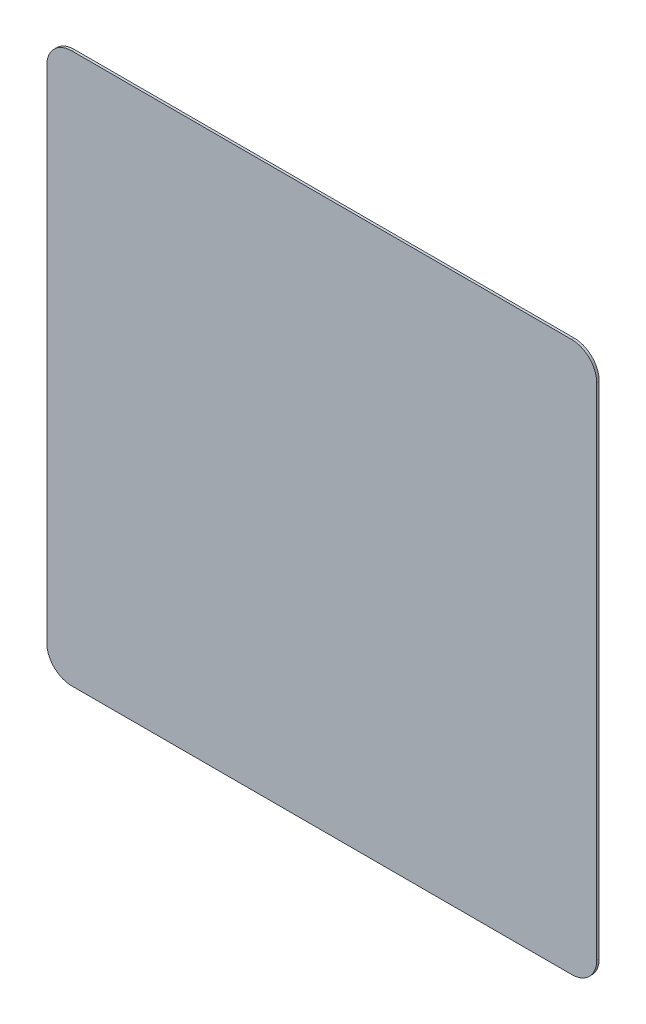
ISO-10303-21;
HEADER;
FILE_DESCRIPTION(('STEP AP214'),'2;1');
FILE_NAME('part.step','',(''),(''),'','','');
FILE_SCHEMA(('AUTOMOTIVE_DESIGN { 1 0 10303 214 1 1 1 1 }'));
ENDSEC;
DATA;
#1=APPLICATION_CONTEXT('core data for automotive mechanical design processes');
#2=APPLICATION_PROTOCOL_DEFINITION('international standard','automotive_design',2000,#1);
#3=PRODUCT_CONTEXT('',#1,'mechanical');
#4=PRODUCT('Part','Part','',(#3));
#5=PRODUCT_RELATED_PRODUCT_CATEGORY('part','',(#4));
#6=PRODUCT_DEFINITION_FORMATION('','',#4);
#7=PRODUCT_DEFINITION_CONTEXT('part definition',#1,'design');
#8=PRODUCT_DEFINITION('design','',#6,#7);
#9=PRODUCT_DEFINITION_SHAPE('','',#8);
#10=(LENGTH_UNIT() NAMED_UNIT(*) SI_UNIT(.MILLI.,.METRE.));
#11=(NAMED_UNIT(*) PLANE_ANGLE_UNIT() SI_UNIT($,.RADIAN.));
#12=(NAMED_UNIT(*) SI_UNIT($,.STERADIAN.) SOLID_ANGLE_UNIT());
#13=UNCERTAINTY_MEASURE_WITH_UNIT(LENGTH_MEASURE(1.E-05),#10,'distance_accuracy_value','');
#14=(GEOMETRIC_REPRESENTATION_CONTEXT(3) GLOBAL_UNCERTAINTY_ASSIGNED_CONTEXT((#13)) GLOBAL_UNIT_ASSIGNED_CONTEXT((#10,
#11,#12)) REPRESENTATION_CONTEXT('',''));
#15=CARTESIAN_POINT('',(0.,0.,0.));
#16=DIRECTION('',(0.,0.,1.));
#17=DIRECTION('',(1.,0.,0.));
#18=AXIS2_PLACEMENT_3D('',#15,#16,#17);
#19=CARTESIAN_POINT('',(-2.75,0.,0.025));
#20=DIRECTION('',(-1.,0.,0.));
#21=DIRECTION('',(0.,0.,1.));
#22=AXIS2_PLACEMENT_3D('',#19,#20,#21);
#23=PLANE('',#22);
#24=DIRECTION('',(0.,1.,0.));
#25=VECTOR('',#24,1.);
#26=CARTESIAN_POINT('',(-2.75,0.,0.025));
#27=LINE('',#26,#25);
#28=CARTESIAN_POINT('',(-2.75,-2.5,0.025));
#29=VERTEX_POINT('',#28);
#30=CARTESIAN_POINT('',(-2.75,2.5,0.025));
#31=VERTEX_POINT('',#30);
#32=EDGE_CURVE('E121',#29,#31,#27,.T.);
#33=ORIENTED_EDGE('',*,*,#32,.T.);
#34=DIRECTION('',(0.,0.,-1.));
#35=VECTOR('',#34,1.);
#36=CARTESIAN_POINT('',(-2.75,2.5,0.025));
#37=LINE('',#36,#35);
#38=CARTESIAN_POINT('',(-2.75,2.5,0.));
#39=VERTEX_POINT('',#38);
#40=EDGE_CURVE('E151',#31,#39,#37,.T.);
#41=ORIENTED_EDGE('',*,*,#40,.T.);
#42=DIRECTION('',(0.,1.,0.));
#43=VECTOR('',#42,1.);
#44=CARTESIAN_POINT('',(-2.75,0.,0.));
#45=LINE('',#44,#43);
#46=CARTESIAN_POINT('',(-2.75,-2.5,0.));
#47=VERTEX_POINT('',#46);
#48=EDGE_CURVE('E105',#47,#39,#45,.T.);
#49=ORIENTED_EDGE('',*,*,#48,.F.);
#50=DIRECTION('',(0.,0.,-1.));
#51=VECTOR('',#50,1.);
#52=CARTESIAN_POINT('',(-2.75,-2.5,0.025));
#53=LINE('',#52,#51);
#54=EDGE_CURVE('E149',#47,#29,#53,.F.);
#55=ORIENTED_EDGE('',*,*,#54,.T.);
#56=EDGE_LOOP('',(#33,#41,#49,#55));
#57=FACE_BOUND('',#56,.T.);
#58=ADVANCED_FACE('F35',(#57),#23,.T.);
#59=CARTESIAN_POINT('',(0.,-2.75,0.025));
#60=DIRECTION('',(0.,1.,0.));
#61=DIRECTION('',(0.,0.,1.));
#62=AXIS2_PLACEMENT_3D('',#59,#60,#61);
#63=PLANE('',#62);
#64=DIRECTION('',(1.,0.,0.));
#65=VECTOR('',#64,1.);
#66=CARTESIAN_POINT('',(0.,-2.75,0.));
#67=LINE('',#66,#65);
#68=CARTESIAN_POINT('',(-2.5,-2.75,0.));
#69=VERTEX_POINT('',#68);
#70=CARTESIAN_POINT('',(2.5,-2.75,0.));
#71=VERTEX_POINT('',#70);
#72=EDGE_CURVE('E156',#69,#71,#67,.T.);
#73=ORIENTED_EDGE('',*,*,#72,.T.);
#74=DIRECTION('',(0.,0.,-1.));
#75=VECTOR('',#74,1.);
#76=CARTESIAN_POINT('',(2.5,-2.75,0.025));
#77=LINE('',#76,#75);
#78=CARTESIAN_POINT('',(2.5,-2.75,0.025));
#79=VERTEX_POINT('',#78);
#80=EDGE_CURVE('E11',#71,#79,#77,.F.);
#81=ORIENTED_EDGE('',*,*,#80,.T.);
#82=DIRECTION('',(1.,0.,0.));
#83=VECTOR('',#82,1.);
#84=CARTESIAN_POINT('',(0.,-2.75,0.025));
#85=LINE('',#84,#83);
#86=CARTESIAN_POINT('',(-2.5,-2.75,0.025));
#87=VERTEX_POINT('',#86);
#88=EDGE_CURVE('E157',#87,#79,#85,.T.);
#89=ORIENTED_EDGE('',*,*,#88,.F.);
#90=DIRECTION('',(0.,0.,-1.));
#91=VECTOR('',#90,1.);
#92=CARTESIAN_POINT('',(-2.5,-2.75,0.));
#93=LINE('',#92,#91);
#94=EDGE_CURVE('E43',#87,#69,#93,.T.);
#95=ORIENTED_EDGE('',*,*,#94,.T.);
#96=EDGE_LOOP('',(#73,#81,#89,#95));
#97=FACE_BOUND('',#96,.T.);
#98=ADVANCED_FACE('F155',(#97),#63,.F.);
#99=CARTESIAN_POINT('',(2.75,0.,0.025));
#100=DIRECTION('',(-1.,0.,0.));
#101=DIRECTION('',(0.,0.,1.));
#102=AXIS2_PLACEMENT_3D('',#99,#100,#101);
#103=PLANE('',#102);
#104=DIRECTION('',(0.,1.,0.));
#105=VECTOR('',#104,1.);
#106=CARTESIAN_POINT('',(2.75,0.,0.));
#107=LINE('',#106,#105);
#108=CARTESIAN_POINT('',(2.75,-2.5,0.));
#109=VERTEX_POINT('',#108);
#110=CARTESIAN_POINT('',(2.75,2.5,0.));
#111=VERTEX_POINT('',#110);
#112=EDGE_CURVE('E122',#109,#111,#107,.T.);
#113=ORIENTED_EDGE('',*,*,#112,.T.);
#114=DIRECTION('',(0.,0.,-1.));
#115=VECTOR('',#114,1.);
#116=CARTESIAN_POINT('',(2.75,2.5,0.025));
#117=LINE('',#116,#115);
#118=CARTESIAN_POINT('',(2.75,2.5,0.025));
#119=VERTEX_POINT('',#118);
#120=EDGE_CURVE('E141',#111,#119,#117,.F.);
#121=ORIENTED_EDGE('',*,*,#120,.T.);
#122=DIRECTION('',(0.,1.,0.));
#123=VECTOR('',#122,1.);
#124=CARTESIAN_POINT('',(2.75,0.,0.025));
#125=LINE('',#124,#123);
#126=CARTESIAN_POINT('',(2.75,-2.5,0.025));
#127=VERTEX_POINT('',#126);
#128=EDGE_CURVE('E131',#127,#119,#125,.T.);
#129=ORIENTED_EDGE('',*,*,#128,.F.);
#130=DIRECTION('',(0.,0.,-1.));
#131=VECTOR('',#130,1.);
#132=CARTESIAN_POINT('',(2.75,-2.5,0.025));
#133=LINE('',#132,#131);
#134=EDGE_CURVE('E138',#127,#109,#133,.T.);
#135=ORIENTED_EDGE('',*,*,#134,.T.);
#136=EDGE_LOOP('',(#113,#121,#129,#135));
#137=FACE_BOUND('',#136,.T.);
#138=ADVANCED_FACE('F182',(#137),#103,.F.);
#139=CARTESIAN_POINT('',(0.,2.75,0.025));
#140=DIRECTION('',(0.,1.,0.));
#141=DIRECTION('',(0.,0.,1.));
#142=AXIS2_PLACEMENT_3D('',#139,#140,#141);
#143=PLANE('',#142);
#144=DIRECTION('',(1.,0.,0.));
#145=VECTOR('',#144,1.);
#146=CARTESIAN_POINT('',(0.,2.75,0.025));
#147=LINE('',#146,#145);
#148=CARTESIAN_POINT('',(-2.5,2.75,0.025));
#149=VERTEX_POINT('',#148);
#150=CARTESIAN_POINT('',(2.5,2.75,0.025));
#151=VERTEX_POINT('',#150);
#152=EDGE_CURVE('E127',#149,#151,#147,.T.);
#153=ORIENTED_EDGE('',*,*,#152,.T.);
#154=DIRECTION('',(0.,0.,-1.));
#155=VECTOR('',#154,1.);
#156=CARTESIAN_POINT('',(2.5,2.75,0.));
#157=LINE('',#156,#155);
#158=CARTESIAN_POINT('',(2.5,2.75,0.));
#159=VERTEX_POINT('',#158);
#160=EDGE_CURVE('E120',#151,#159,#157,.T.);
#161=ORIENTED_EDGE('',*,*,#160,.T.);
#162=DIRECTION('',(1.,0.,0.));
#163=VECTOR('',#162,1.);
#164=CARTESIAN_POINT('',(0.,2.75,0.));
#165=LINE('',#164,#163);
#166=CARTESIAN_POINT('',(-2.5,2.75,0.));
#167=VERTEX_POINT('',#166);
#168=EDGE_CURVE('E103',#167,#159,#165,.T.);
#169=ORIENTED_EDGE('',*,*,#168,.F.);
#170=DIRECTION('',(0.,0.,-1.));
#171=VECTOR('',#170,1.);
#172=CARTESIAN_POINT('',(-2.5,2.75,0.025));
#173=LINE('',#172,#171);
#174=EDGE_CURVE('E117',#167,#149,#173,.F.);
#175=ORIENTED_EDGE('',*,*,#174,.T.);
#176=EDGE_LOOP('',(#153,#161,#169,#175));
#177=FACE_BOUND('',#176,.T.);
#178=ADVANCED_FACE('F116',(#177),#143,.T.);
#179=CARTESIAN_POINT('',(0.,0.,0.025));
#180=DIRECTION('',(0.,0.,1.));
#181=DIRECTION('',(1.,0.,0.));
#182=AXIS2_PLACEMENT_3D('',#179,#180,#181);
#183=PLANE('',#182);
#184=ORIENTED_EDGE('',*,*,#128,.T.);
#185=CARTESIAN_POINT('',(2.5,2.5,0.025));
#186=DIRECTION('',(0.,0.,1.));
#187=DIRECTION('',(1.,0.,0.));
#188=AXIS2_PLACEMENT_3D('',#185,#186,#187);
#189=CIRCLE('',#188,0.25);
#190=EDGE_CURVE('E147',#119,#151,#189,.T.);
#191=ORIENTED_EDGE('',*,*,#190,.T.);
#192=ORIENTED_EDGE('',*,*,#152,.F.);
#193=CARTESIAN_POINT('',(-2.5,2.5,0.025));
#194=DIRECTION('',(0.,0.,1.));
#195=DIRECTION('',(1.,0.,0.));
#196=AXIS2_PLACEMENT_3D('',#193,#194,#195);
#197=CIRCLE('',#196,0.25);
#198=EDGE_CURVE('E126',#149,#31,#197,.T.);
#199=ORIENTED_EDGE('',*,*,#198,.T.);
#200=ORIENTED_EDGE('',*,*,#32,.F.);
#201=CARTESIAN_POINT('',(-2.5,-2.5,0.025));
#202=DIRECTION('',(0.,0.,1.));
#203=DIRECTION('',(1.,0.,0.));
#204=AXIS2_PLACEMENT_3D('',#201,#202,#203);
#205=CIRCLE('',#204,0.25);
#206=EDGE_CURVE('E55',#29,#87,#205,.T.);
#207=ORIENTED_EDGE('',*,*,#206,.T.);
#208=ORIENTED_EDGE('',*,*,#88,.T.);
#209=CARTESIAN_POINT('',(2.5,-2.5,0.025));
#210=DIRECTION('',(0.,0.,1.));
#211=DIRECTION('',(1.,0.,0.));
#212=AXIS2_PLACEMENT_3D('',#209,#210,#211);
#213=CIRCLE('',#212,0.25);
#214=EDGE_CURVE('E144',#79,#127,#213,.T.);
#215=ORIENTED_EDGE('',*,*,#214,.T.);
#216=EDGE_LOOP('',(#184,#191,#192,#199,#200,#207,#208,#215));
#217=FACE_BOUND('',#216,.T.);
#218=ADVANCED_FACE('F170',(#217),#183,.T.);
#219=CARTESIAN_POINT('',(0.,0.,0.));
#220=DIRECTION('',(0.,0.,1.));
#221=DIRECTION('',(1.,0.,0.));
#222=AXIS2_PLACEMENT_3D('',#219,#220,#221);
#223=PLANE('',#222);
#224=ORIENTED_EDGE('',*,*,#168,.T.);
#225=CARTESIAN_POINT('',(2.5,2.5,0.));
#226=DIRECTION('',(0.,0.,1.));
#227=DIRECTION('',(1.,0.,0.));
#228=AXIS2_PLACEMENT_3D('',#225,#226,#227);
#229=CIRCLE('',#228,0.25);
#230=EDGE_CURVE('E110',#159,#111,#229,.F.);
#231=ORIENTED_EDGE('',*,*,#230,.T.);
#232=ORIENTED_EDGE('',*,*,#112,.F.);
#233=CARTESIAN_POINT('',(2.5,-2.5,0.));
#234=DIRECTION('',(0.,0.,1.));
#235=DIRECTION('',(1.,0.,0.));
#236=AXIS2_PLACEMENT_3D('',#233,#234,#235);
#237=CIRCLE('',#236,0.25);
#238=EDGE_CURVE('E111',#109,#71,#237,.F.);
#239=ORIENTED_EDGE('',*,*,#238,.T.);
#240=ORIENTED_EDGE('',*,*,#72,.F.);
#241=CARTESIAN_POINT('',(-2.5,-2.5,0.));
#242=DIRECTION('',(0.,0.,1.));
#243=DIRECTION('',(1.,0.,0.));
#244=AXIS2_PLACEMENT_3D('',#241,#242,#243);
#245=CIRCLE('',#244,0.25);
#246=EDGE_CURVE('E129',#69,#47,#245,.F.);
#247=ORIENTED_EDGE('',*,*,#246,.T.);
#248=ORIENTED_EDGE('',*,*,#48,.T.);
#249=CARTESIAN_POINT('',(-2.5,2.5,0.));
#250=DIRECTION('',(0.,0.,1.));
#251=DIRECTION('',(1.,0.,0.));
#252=AXIS2_PLACEMENT_3D('',#249,#250,#251);
#253=CIRCLE('',#252,0.25);
#254=EDGE_CURVE('E100',#39,#167,#253,.F.);
#255=ORIENTED_EDGE('',*,*,#254,.T.);
#256=EDGE_LOOP('',(#224,#231,#232,#239,#240,#247,#248,#255));
#257=FACE_BOUND('',#256,.T.);
#258=ADVANCED_FACE('F102',(#257),#223,.F.);
#259=CARTESIAN_POINT('',(2.5,2.5,0.025));
#260=DIRECTION('',(0.,0.,1.));
#261=DIRECTION('',(1.,0.,0.));
#262=AXIS2_PLACEMENT_3D('',#259,#260,#261);
#263=CYLINDRICAL_SURFACE('',#262,0.25);
#264=ORIENTED_EDGE('',*,*,#190,.F.);
#265=ORIENTED_EDGE('',*,*,#120,.F.);
#266=ORIENTED_EDGE('',*,*,#230,.F.);
#267=ORIENTED_EDGE('',*,*,#160,.F.);
#268=EDGE_LOOP('',(#264,#265,#266,#267));
#269=FACE_BOUND('',#268,.T.);
#270=ADVANCED_FACE('F186',(#269),#263,.T.);
#271=CARTESIAN_POINT('',(-2.5,2.5,0.025));
#272=DIRECTION('',(0.,0.,-1.));
#273=DIRECTION('',(-1.,0.,0.));
#274=AXIS2_PLACEMENT_3D('',#271,#272,#273);
#275=CYLINDRICAL_SURFACE('',#274,0.25);
#276=ORIENTED_EDGE('',*,*,#198,.F.);
#277=ORIENTED_EDGE('',*,*,#174,.F.);
#278=ORIENTED_EDGE('',*,*,#254,.F.);
#279=ORIENTED_EDGE('',*,*,#40,.F.);
#280=EDGE_LOOP('',(#276,#277,#278,#279));
#281=FACE_BOUND('',#280,.T.);
#282=ADVANCED_FACE('F125',(#281),#275,.T.);
#283=CARTESIAN_POINT('',(2.5,-2.5,0.025));
#284=DIRECTION('',(0.,0.,-1.));
#285=DIRECTION('',(-1.,0.,0.));
#286=AXIS2_PLACEMENT_3D('',#283,#284,#285);
#287=CYLINDRICAL_SURFACE('',#286,0.25);
#288=ORIENTED_EDGE('',*,*,#214,.F.);
#289=ORIENTED_EDGE('',*,*,#80,.F.);
#290=ORIENTED_EDGE('',*,*,#238,.F.);
#291=ORIENTED_EDGE('',*,*,#134,.F.);
#292=EDGE_LOOP('',(#288,#289,#290,#291));
#293=FACE_BOUND('',#292,.T.);
#294=ADVANCED_FACE('F172',(#293),#287,.T.);
#295=CARTESIAN_POINT('',(-2.5,-2.5,0.025));
#296=DIRECTION('',(0.,0.,1.));
#297=DIRECTION('',(1.,0.,0.));
#298=AXIS2_PLACEMENT_3D('',#295,#296,#297);
#299=CYLINDRICAL_SURFACE('',#298,0.25);
#300=ORIENTED_EDGE('',*,*,#206,.F.);
#301=ORIENTED_EDGE('',*,*,#54,.F.);
#302=ORIENTED_EDGE('',*,*,#246,.F.);
#303=ORIENTED_EDGE('',*,*,#94,.F.);
#304=EDGE_LOOP('',(#300,#301,#302,#303));
#305=FACE_BOUND('',#304,.T.);
#306=ADVANCED_FACE('F37',(#305),#299,.T.);
#307=CLOSED_SHELL('',(#58,#98,#138,#178,#218,#258,#270,#282,#294,#306));
#308=MANIFOLD_SOLID_BREP('B2',#307);
#309=ADVANCED_BREP_SHAPE_REPRESENTATION('',(#18,#308),#14);
#310=SHAPE_DEFINITION_REPRESENTATION(#9,#309);
ENDSEC;
END-ISO-10303-21;
